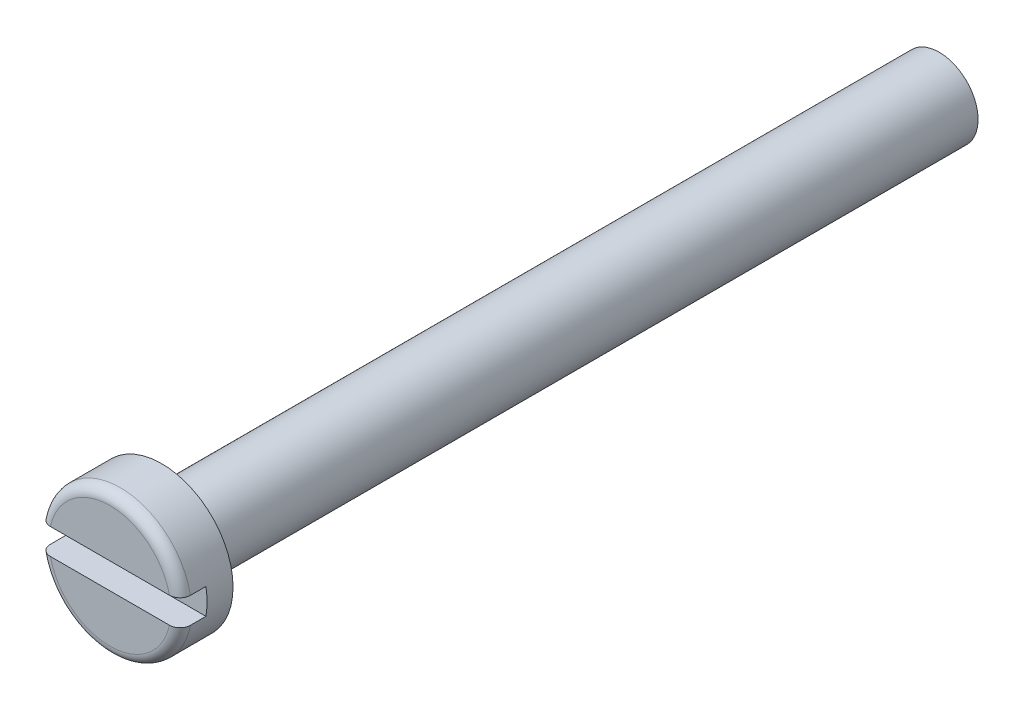
ISO-10303-21;
HEADER;
FILE_DESCRIPTION(('STEP AP214'),'2;1');
FILE_NAME('part.step','',(''),(''),'','','');
FILE_SCHEMA(('AUTOMOTIVE_DESIGN { 1 0 10303 214 1 1 1 1 }'));
ENDSEC;
DATA;
#1=APPLICATION_CONTEXT('core data for automotive mechanical design processes');
#2=APPLICATION_PROTOCOL_DEFINITION('international standard','automotive_design',2000,#1);
#3=PRODUCT_CONTEXT('',#1,'mechanical');
#4=PRODUCT('Part','Part','',(#3));
#5=PRODUCT_RELATED_PRODUCT_CATEGORY('part','',(#4));
#6=PRODUCT_DEFINITION_FORMATION('','',#4);
#7=PRODUCT_DEFINITION_CONTEXT('part definition',#1,'design');
#8=PRODUCT_DEFINITION('design','',#6,#7);
#9=PRODUCT_DEFINITION_SHAPE('','',#8);
#10=(LENGTH_UNIT() NAMED_UNIT(*) SI_UNIT(.MILLI.,.METRE.));
#11=(NAMED_UNIT(*) PLANE_ANGLE_UNIT() SI_UNIT($,.RADIAN.));
#12=(NAMED_UNIT(*) SI_UNIT($,.STERADIAN.) SOLID_ANGLE_UNIT());
#13=UNCERTAINTY_MEASURE_WITH_UNIT(LENGTH_MEASURE(1.E-05),#10,'distance_accuracy_value','');
#14=(GEOMETRIC_REPRESENTATION_CONTEXT(3) GLOBAL_UNCERTAINTY_ASSIGNED_CONTEXT((#13)) GLOBAL_UNIT_ASSIGNED_CONTEXT((#10,
#11,#12)) REPRESENTATION_CONTEXT('',''));
#15=CARTESIAN_POINT('',(0.,0.,0.));
#16=DIRECTION('',(0.,0.,1.));
#17=DIRECTION('',(1.,0.,0.));
#18=AXIS2_PLACEMENT_3D('',#15,#16,#17);
#19=CARTESIAN_POINT('',(0.,0.,2.));
#20=DIRECTION('',(0.,0.,1.));
#21=DIRECTION('',(1.,0.,0.));
#22=AXIS2_PLACEMENT_3D('',#19,#20,#21);
#23=PLANE('',#22);
#24=DIRECTION('',(1.,0.,0.));
#25=VECTOR('',#24,1.);
#26=CARTESIAN_POINT('',(-3.92550642529954,-0.5,2.));
#27=LINE('',#26,#25);
#28=CARTESIAN_POINT('',(-2.29619250064101,-0.5,2.));
#29=VERTEX_POINT('',#28);
#30=CARTESIAN_POINT('',(2.29619250064101,-0.5,2.));
#31=VERTEX_POINT('',#30);
#32=EDGE_CURVE('E104',#29,#31,#27,.T.);
#33=ORIENTED_EDGE('',*,*,#32,.F.);
#34=CARTESIAN_POINT('',(0.,0.,2.));
#35=DIRECTION('',(0.,0.,1.));
#36=DIRECTION('',(1.,0.,0.));
#37=AXIS2_PLACEMENT_3D('',#34,#35,#36);
#38=CIRCLE('',#37,2.35);
#39=EDGE_CURVE('E108',#29,#31,#38,.T.);
#40=ORIENTED_EDGE('',*,*,#39,.T.);
#41=EDGE_LOOP('',(#33,#40));
#42=FACE_BOUND('',#41,.T.);
#43=ADVANCED_FACE('F33',(#42),#23,.T.);
#44=CARTESIAN_POINT('',(0.,0.,1.6));
#45=DIRECTION('',(0.,0.,1.));
#46=DIRECTION('',(1.,0.,0.));
#47=AXIS2_PLACEMENT_3D('',#44,#45,#46);
#48=TOROIDAL_SURFACE('',#47,2.35,0.4);
#49=CARTESIAN_POINT('',(-2.62619038091012,-0.5,1.83544770515883));
#50=CARTESIAN_POINT('',(-2.61263356226729,-0.5,1.85373623025664));
#51=CARTESIAN_POINT('',(-2.59749956242839,-0.5,1.87087869161401));
#52=CARTESIAN_POINT('',(-2.56454221813394,-0.5,1.90237883040798));
#53=CARTESIAN_POINT('',(-2.54671511248543,-0.5,1.91673254796232));
#54=CARTESIAN_POINT('',(-2.5089357551136,-0.5,1.94224083583466));
#55=CARTESIAN_POINT('',(-2.48898626391397,-0.5,1.95339949375539));
#56=CARTESIAN_POINT('',(-2.44752396577556,-0.5,1.97225919789647));
#57=CARTESIAN_POINT('',(-2.42601154513596,-0.5,1.9799610951469));
#58=CARTESIAN_POINT('',(-2.38170155593168,-0.5,1.99181795211972));
#59=CARTESIAN_POINT('',(-2.35889003302304,-0.5,1.99592075157835));
#60=CARTESIAN_POINT('',(-2.31290143156169,-0.5,2.00030498144866));
#61=CARTESIAN_POINT('',(-2.28972430162224,-0.5,2.00058586980512));
#62=CARTESIAN_POINT('',(-2.24326799051151,-0.5,1.99730780671908));
#63=CARTESIAN_POINT('',(-2.21999314999985,-0.5,1.99368710497535));
#64=CARTESIAN_POINT('',(-2.17437295895557,-0.5,1.98261165729567));
#65=CARTESIAN_POINT('',(-2.15202766541745,-0.5,1.97515667663707));
#66=CARTESIAN_POINT('',(-2.10878909796141,-0.5,1.95655872141571));
#67=CARTESIAN_POINT('',(-2.0879039293106,-0.5,1.94539687691259));
#68=CARTESIAN_POINT('',(-2.0483329187925,-0.5,1.9196847476073));
#69=CARTESIAN_POINT('',(-2.0296469974799,-0.5,1.90513458526086));
#70=CARTESIAN_POINT('',(-1.99526919643116,-0.5,1.87322793915014));
#71=CARTESIAN_POINT('',(-1.97954359912245,-0.5,1.85590782263228));
#72=CARTESIAN_POINT('',(-1.95132308293,-0.5,1.8188085014007));
#73=CARTESIAN_POINT('',(-1.93882763644293,-0.5,1.79902969906402));
#74=CARTESIAN_POINT('',(-1.91780235126346,-0.5,1.75816072094503));
#75=CARTESIAN_POINT('',(-1.90917182223496,-0.5,1.73712236345806));
#76=CARTESIAN_POINT('',(-1.89568517834923,-0.5,1.69386915533978));
#77=CARTESIAN_POINT('',(-1.89082831625216,-0.5,1.67165453855563));
#78=CARTESIAN_POINT('',(-1.88515147779902,-0.5,1.62736952064434));
#79=CARTESIAN_POINT('',(-1.88421892462332,-0.5,1.60531349564045));
#80=CARTESIAN_POINT('',(-1.88611470329609,-0.5,1.56136496556786));
#81=CARTESIAN_POINT('',(-1.88894271848453,-0.5,1.53947244688713));
#82=CARTESIAN_POINT('',(-1.89820787052979,-0.5,1.49671300748623));
#83=CARTESIAN_POINT('',(-1.90460608571138,-0.5,1.47583762233463));
#84=CARTESIAN_POINT('',(-1.92076706511562,-0.5,1.43543421848883));
#85=CARTESIAN_POINT('',(-1.93053001760281,-0.5,1.41590627526042));
#86=CARTESIAN_POINT('',(-1.95327387474353,-0.5,1.37843460780815));
#87=CARTESIAN_POINT('',(-1.96629961172802,-0.5,1.36051812530724));
#88=CARTESIAN_POINT('',(-1.99509439024952,-0.5,1.32704642120958));
#89=CARTESIAN_POINT('',(-2.01086381478228,-0.5,1.31149152983955));
#90=CARTESIAN_POINT('',(-2.04519240192099,-0.5,1.28269919385505));
#91=CARTESIAN_POINT('',(-2.0638198755551,-0.5,1.26954319397974));
#92=CARTESIAN_POINT('',(-2.10297306437774,-0.5,1.24644959051631));
#93=CARTESIAN_POINT('',(-2.12349905296588,-0.5,1.23651245139752));
#94=CARTESIAN_POINT('',(-2.16645235686171,-0.5,1.21987982977083));
#95=CARTESIAN_POINT('',(-2.18891559535475,-0.5,1.21327700938222));
#96=CARTESIAN_POINT('',(-2.23462689324369,-0.5,1.20388861373709));
#97=CARTESIAN_POINT('',(-2.25787501610413,-0.5,1.20110334792322));
#98=CARTESIAN_POINT('',(-2.30477444629637,-0.5,1.19942424019881));
#99=CARTESIAN_POINT('',(-2.32842735100207,-0.5,1.20057440024381));
#100=CARTESIAN_POINT('',(-2.37520044576303,-0.5,1.20685220842419));
#101=CARTESIAN_POINT('',(-2.39832064202178,-0.5,1.2119798102173));
#102=CARTESIAN_POINT('',(-2.44322365819375,-0.5,1.22605462671592));
#103=CARTESIAN_POINT('',(-2.46501338004882,-0.5,1.23497979435747));
#104=CARTESIAN_POINT('',(-2.50674878210765,-0.5,1.25642175857502));
#105=CARTESIAN_POINT('',(-2.52669460796329,-0.5,1.26893827114465));
#106=CARTESIAN_POINT('',(-2.56381815052492,-0.5,1.29699037466751));
#107=CARTESIAN_POINT('',(-2.581036270014,-0.5,1.31247248392922));
#108=CARTESIAN_POINT('',(-2.61256596627527,-0.5,1.34615807457712));
#109=CARTESIAN_POINT('',(-2.62687784820374,-0.5,1.36436126989919));
#110=CARTESIAN_POINT('',(-2.65190073733828,-0.5,1.40259690391388));
#111=CARTESIAN_POINT('',(-2.66267533478993,-0.5,1.42258773469947));
#112=CARTESIAN_POINT('',(-2.68065593055762,-0.5,1.46411367848379));
#113=CARTESIAN_POINT('',(-2.68786240237232,-0.5,1.48564858614544));
#114=CARTESIAN_POINT('',(-2.6983988782491,-0.5,1.52930119247272));
#115=CARTESIAN_POINT('',(-2.70178583819472,-0.5,1.55140515911834));
#116=CARTESIAN_POINT('',(-2.704772478132,-0.5,1.59587340763234));
#117=CARTESIAN_POINT('',(-2.70437137438759,-0.5,1.61823774241392));
#118=CARTESIAN_POINT('',(-2.69980893202067,-0.5,1.66243006884283));
#119=CARTESIAN_POINT('',(-2.6956719204913,-0.5,1.68426059323067));
#120=CARTESIAN_POINT('',(-2.68380053632379,-0.5,1.72689974520276));
#121=CARTESIAN_POINT('',(-2.67607067463867,-0.5,1.74770961813577));
#122=CARTESIAN_POINT('',(-2.66106770941279,-0.5,1.77964182264717));
#123=CARTESIAN_POINT('',(-2.65487094721183,-0.5,1.79128235889515));
#124=CARTESIAN_POINT('',(-2.6413557076963,-0.5,1.8138924805216));
#125=CARTESIAN_POINT('',(-2.63403724129826,-0.5,1.8248620724283));
#126=CARTESIAN_POINT('',(-2.62619038091012,-0.5,1.83544770515883));
#127=B_SPLINE_CURVE_WITH_KNOTS('',3,(#49,#50,#51,#52,#53,#54,#55,#56,#57,#58,#59,#60,#61,#62,
#63,#64,#65,#66,#67,#68,#69,#70,#71,#72,#73,#74,#75,#76,#77,#78,#79,#80,#81,#82,#83,#84,#85,#86,
#87,#88,#89,#90,#91,#92,#93,#94,#95,#96,#97,#98,#99,#100,#101,#102,#103,#104,#105,#106,#107,
#108,#109,#110,#111,#112,#113,#114,#115,#116,#117,#118,#119,#120,#121,#122,#123,#124,#125,#126),
.UNSPECIFIED.,.T.,.F.,(4,2,2,2,2,2,2,2,2,2,2,2,2,2,2,2,2,2,2,2,2,2,2,2,2,2,2,2,2,2,2,2,2,2,2,2,
2,2,4),(0.,0.0682466075946623,0.136589424983843,0.204844413213554,0.27308258831698,
0.342294107419759,0.411515442573491,0.481848652692143,0.552186168904159,0.622887374396228,
0.693586025103103,0.763422946686154,0.833248454094187,0.901130604340126,0.968999309524789,
1.03490719957912,1.10080954018712,1.16600707965001,1.23120826765307,1.29735986584561,
1.36352070566509,1.43162394658118,1.49973701016197,1.56965109030662,1.63957083719914,
1.71027489879905,1.78097813661885,1.85127638474918,1.92156907517067,1.99069662744444,
2.05981691753606,2.12761622572643,2.19540653437585,2.26217201672031,2.32895131289338,
2.39529887364471,2.46156335672852,2.50106575233715,2.5405677635293),.UNSPECIFIED.);
#128=CARTESIAN_POINT('',(-2.70416345659957,-0.5,1.60000000000024));
#129=VERTEX_POINT('',#128);
#130=EDGE_CURVE('E159',#129,#29,#127,.T.);
#131=ORIENTED_EDGE('',*,*,#130,.F.);
#132=CARTESIAN_POINT('',(0.,0.,1.6));
#133=DIRECTION('',(0.,0.,1.));
#134=DIRECTION('',(1.,0.,0.));
#135=AXIS2_PLACEMENT_3D('',#132,#133,#134);
#136=CIRCLE('',#135,2.75);
#137=CARTESIAN_POINT('',(2.70416345659799,-0.5,1.6));
#138=VERTEX_POINT('',#137);
#139=EDGE_CURVE('E98',#138,#129,#136,.F.);
#140=ORIENTED_EDGE('',*,*,#139,.F.);
#141=CARTESIAN_POINT('',(1.92898309832126,-0.5,1.77988516986034));
#142=CARTESIAN_POINT('',(1.93949314461507,-0.5,1.80008889508743));
#143=CARTESIAN_POINT('',(1.9517593009419,-0.5,1.81940117916716));
#144=CARTESIAN_POINT('',(1.97939319938233,-0.5,1.85569065074395));
#145=CARTESIAN_POINT('',(1.99476579816306,-0.5,1.8726641109168));
#146=CARTESIAN_POINT('',(2.02809475448498,-0.5,1.9037852390774));
#147=CARTESIAN_POINT('',(2.0460465708081,-0.5,1.91793777143818));
#148=CARTESIAN_POINT('',(2.08402281258443,-0.5,1.94309729142046));
#149=CARTESIAN_POINT('',(2.10404669450162,-0.5,1.95410510111816));
#150=CARTESIAN_POINT('',(2.14605533698852,-0.5,1.97291081898203));
#151=CARTESIAN_POINT('',(2.16807240860476,-0.5,1.98063658560144));
#152=CARTESIAN_POINT('',(2.21308297016805,-0.5,1.99234115731671));
#153=CARTESIAN_POINT('',(2.23607659861224,-0.5,1.99631942906876));
#154=CARTESIAN_POINT('',(2.28273224588002,-0.5,2.00044623133229));
#155=CARTESIAN_POINT('',(2.30639911630732,-0.5,2.00054021782789));
#156=CARTESIAN_POINT('',(2.35341169198468,-0.5,1.99674061125416));
#157=CARTESIAN_POINT('',(2.37675739657881,-0.5,1.99284701004225));
#158=CARTESIAN_POINT('',(2.42237496676976,-0.5,1.9811754503234));
#159=CARTESIAN_POINT('',(2.44465017067156,-0.5,1.97341056064841));
#160=CARTESIAN_POINT('',(2.48755003023635,-0.5,1.95419365820212));
#161=CARTESIAN_POINT('',(2.50817481050276,-0.5,1.94274192410815));
#162=CARTESIAN_POINT('',(2.54684281436288,-0.5,1.91665872778678));
#163=CARTESIAN_POINT('',(2.56492096377046,-0.5,1.90207906041399));
#164=CARTESIAN_POINT('',(2.59831240421815,-0.5,1.87003740057132));
#165=CARTESIAN_POINT('',(2.61362598376942,-0.5,1.85257570923464));
#166=CARTESIAN_POINT('',(2.64074157086097,-0.5,1.81562763426819));
#167=CARTESIAN_POINT('',(2.65260546308916,-0.5,1.79618666114354));
#168=CARTESIAN_POINT('',(2.67283925008361,-0.5,1.75556423228347));
#169=CARTESIAN_POINT('',(2.68120948302296,-0.5,1.73438294524156));
#170=CARTESIAN_POINT('',(2.6940865759711,-0.5,1.69124634781257));
#171=CARTESIAN_POINT('',(2.6986530401699,-0.5,1.66930881716444));
#172=CARTESIAN_POINT('',(2.70400363251708,-0.5,1.62497758367981));
#173=CARTESIAN_POINT('',(2.70478798437058,-0.5,1.60258390790215));
#174=CARTESIAN_POINT('',(2.70255963456268,-0.5,1.55817508605599));
#175=CARTESIAN_POINT('',(2.6995786366752,-0.5,1.53615834054798));
#176=CARTESIAN_POINT('',(2.68996584539524,-0.5,1.49293756475967));
#177=CARTESIAN_POINT('',(2.68333409261704,-0.5,1.47173352544089));
#178=CARTESIAN_POINT('',(2.66661342677101,-0.5,1.43071097050886));
#179=CARTESIAN_POINT('',(2.65652094915892,-0.5,1.41089390892357));
#180=CARTESIAN_POINT('',(2.63318377216481,-0.5,1.37321317440286));
#181=CARTESIAN_POINT('',(2.61993895661573,-0.5,1.35534957348998));
#182=CARTESIAN_POINT('',(2.590538503046,-0.5,1.32188398012138));
#183=CARTESIAN_POINT('',(2.57435492939053,-0.5,1.30630654055154));
#184=CARTESIAN_POINT('',(2.53963984662458,-0.5,1.27803627960591));
#185=CARTESIAN_POINT('',(2.52110815938156,-0.5,1.26534367728386));
#186=CARTESIAN_POINT('',(2.4818942186644,-0.5,1.24297331584829));
#187=CARTESIAN_POINT('',(2.46118117706353,-0.5,1.2333495387349));
#188=CARTESIAN_POINT('',(2.4184539035586,-0.5,1.21764307888103));
#189=CARTESIAN_POINT('',(2.39643954246585,-0.5,1.21156074837075));
#190=CARTESIAN_POINT('',(2.35128991041328,-0.5,1.20299254848139));
#191=CARTESIAN_POINT('',(2.32814131590417,-0.5,1.2005768527655));
#192=CARTESIAN_POINT('',(2.28176297036809,-0.5,1.19960634410731));
#193=CARTESIAN_POINT('',(2.25853321192711,-0.5,1.20105189359859));
#194=CARTESIAN_POINT('',(2.2123001564848,-0.5,1.20780242823378));
#195=CARTESIAN_POINT('',(2.18930486959504,-0.5,1.21316239962444));
#196=CARTESIAN_POINT('',(2.1445354231758,-0.5,1.22765880273197));
#197=CARTESIAN_POINT('',(2.12276132362222,-0.5,1.23679541974625));
#198=CARTESIAN_POINT('',(2.08102751402734,-0.5,1.25862731323666));
#199=CARTESIAN_POINT('',(2.0610709290768,-0.5,1.2713285713681));
#200=CARTESIAN_POINT('',(2.02361732194556,-0.5,1.29995272784891));
#201=CARTESIAN_POINT('',(2.00612014798541,-0.5,1.31587542724303));
#202=CARTESIAN_POINT('',(1.9744068337949,-0.5,1.35023090404912));
#203=CARTESIAN_POINT('',(1.96014199196738,-0.5,1.36861868236077));
#204=CARTESIAN_POINT('',(1.93501444197417,-0.5,1.40758789318503));
#205=CARTESIAN_POINT('',(1.92415096194598,-0.5,1.42816882658752));
#206=CARTESIAN_POINT('',(1.90648158069921,-0.5,1.47028255049213));
#207=CARTESIAN_POINT('',(1.89956424089211,-0.5,1.49176859032654));
#208=CARTESIAN_POINT('',(1.88954358916969,-0.5,1.53561833365207));
#209=CARTESIAN_POINT('',(1.88644059492938,-0.5,1.5579821100848));
#210=CARTESIAN_POINT('',(1.88419399660113,-0.5,1.60232401591841));
#211=CARTESIAN_POINT('',(1.88495020820612,-0.5,1.62429718905239));
#212=CARTESIAN_POINT('',(1.89016522602117,-0.5,1.66777914342288));
#213=CARTESIAN_POINT('',(1.89461913139879,-0.5,1.68928850069664));
#214=CARTESIAN_POINT('',(1.90439908778385,-0.5,1.7222793577135));
#215=CARTESIAN_POINT('',(1.90854271203907,-0.5,1.73412463728708));
#216=CARTESIAN_POINT('',(1.91794113042095,-0.5,1.75736508634642));
#217=CARTESIAN_POINT('',(1.92319588804724,-0.5,1.76876027060308));
#218=CARTESIAN_POINT('',(1.92898309832126,-0.5,1.77988516986034));
#219=B_SPLINE_CURVE_WITH_KNOTS('',3,(#141,#142,#143,#144,#145,#146,#147,#148,#149,#150,#151,
#152,#153,#154,#155,#156,#157,#158,#159,#160,#161,#162,#163,#164,#165,#166,#167,#168,#169,#170,
#171,#172,#173,#174,#175,#176,#177,#178,#179,#180,#181,#182,#183,#184,#185,#186,#187,#188,#189,
#190,#191,#192,#193,#194,#195,#196,#197,#198,#199,#200,#201,#202,#203,#204,#205,#206,#207,#208,
#209,#210,#211,#212,#213,#214,#215,#216,#217,#218),.UNSPECIFIED.,.T.,.F.,(4,2,2,2,2,2,2,2,2,2,2,
2,2,2,2,2,2,2,2,2,2,2,2,2,2,2,2,2,2,2,2,2,2,2,2,2,2,2,4),(0.,0.0682742800464667,
0.136656138832765,0.204919040780091,0.273164081449024,0.342840022244376,0.412525877828525,
0.483189950363971,0.553854167194391,0.624281432310178,0.694703375293182,0.764038604757446,
0.833366594192709,0.901360931684987,0.969348686053635,1.03624990314771,1.10314716310718,
1.16948489281394,1.2358218845349,1.3022274095799,1.36863538211929,1.43571124768699,
1.50279220481245,1.57099525285094,1.63920508316653,1.70870457623849,1.77821059306995,
1.84871221925534,1.91921730494445,1.98984141663846,2.0604611679389,2.12993321428263,
2.19938948406389,2.26677249506838,2.33416111763805,2.39980938400633,2.46537078042,
2.50296629444463,2.54056057366004),.UNSPECIFIED.);
#220=EDGE_CURVE('E160',#31,#138,#219,.T.);
#221=ORIENTED_EDGE('',*,*,#220,.F.);
#222=ORIENTED_EDGE('',*,*,#39,.F.);
#223=EDGE_LOOP('',(#131,#140,#221,#222));
#224=FACE_BOUND('',#223,.T.);
#225=ADVANCED_FACE('F141',(#224),#48,.T.);
#226=CARTESIAN_POINT('',(0.,0.,2.));
#227=DIRECTION('',(0.,0.,-1.));
#228=DIRECTION('',(-1.,0.,0.));
#229=AXIS2_PLACEMENT_3D('',#226,#227,#228);
#230=CYLINDRICAL_SURFACE('',#229,2.75);
#231=CARTESIAN_POINT('',(0.,0.,1.));
#232=DIRECTION('',(0.,0.,-1.));
#233=DIRECTION('',(-1.,0.,0.));
#234=AXIS2_PLACEMENT_3D('',#231,#232,#233);
#235=CIRCLE('',#234,2.75);
#236=CARTESIAN_POINT('',(2.70416345659799,0.5,1.));
#237=VERTEX_POINT('',#236);
#238=CARTESIAN_POINT('',(2.70416345659799,-0.5,1.));
#239=VERTEX_POINT('',#238);
#240=EDGE_CURVE('E43',#237,#239,#235,.T.);
#241=ORIENTED_EDGE('',*,*,#240,.T.);
#242=DIRECTION('',(0.,0.,-1.));
#243=VECTOR('',#242,1.);
#244=CARTESIAN_POINT('',(2.70416345659799,-0.5,2.));
#245=LINE('',#244,#243);
#246=EDGE_CURVE('E172',#239,#138,#245,.F.);
#247=ORIENTED_EDGE('',*,*,#246,.T.);
#248=ORIENTED_EDGE('',*,*,#139,.T.);
#249=DIRECTION('',(0.,0.,-1.));
#250=VECTOR('',#249,1.);
#251=CARTESIAN_POINT('',(-2.70416345659799,-0.5,2.));
#252=LINE('',#251,#250);
#253=CARTESIAN_POINT('',(-2.70416345659799,-0.5,1.));
#254=VERTEX_POINT('',#253);
#255=EDGE_CURVE('E59',#129,#254,#252,.T.);
#256=ORIENTED_EDGE('',*,*,#255,.T.);
#257=CARTESIAN_POINT('',(-2.70416345659799,0.5,1.));
#258=VERTEX_POINT('',#257);
#259=EDGE_CURVE('E38',#254,#258,#235,.T.);
#260=ORIENTED_EDGE('',*,*,#259,.T.);
#261=DIRECTION('',(0.,0.,-1.));
#262=VECTOR('',#261,1.);
#263=CARTESIAN_POINT('',(-2.70416345659799,0.5,2.));
#264=LINE('',#263,#262);
#265=CARTESIAN_POINT('',(-2.70416345659799,0.5,1.6));
#266=VERTEX_POINT('',#265);
#267=EDGE_CURVE('E169',#258,#266,#264,.F.);
#268=ORIENTED_EDGE('',*,*,#267,.T.);
#269=CARTESIAN_POINT('',(2.70416345659799,0.5,1.6));
#270=VERTEX_POINT('',#269);
#271=EDGE_CURVE('E107',#266,#270,#136,.F.);
#272=ORIENTED_EDGE('',*,*,#271,.T.);
#273=DIRECTION('',(0.,0.,-1.));
#274=VECTOR('',#273,1.);
#275=CARTESIAN_POINT('',(2.70416345659799,0.5,2.));
#276=LINE('',#275,#274);
#277=EDGE_CURVE('E51',#270,#237,#276,.T.);
#278=ORIENTED_EDGE('',*,*,#277,.T.);
#279=EDGE_LOOP('',(#241,#247,#248,#256,#260,#268,#272,#278));
#280=FACE_BOUND('',#279,.T.);
#281=CARTESIAN_POINT('',(0.,0.,0.));
#282=DIRECTION('',(0.,0.,1.));
#283=DIRECTION('',(1.,0.,0.));
#284=AXIS2_PLACEMENT_3D('',#281,#282,#283);
#285=CIRCLE('',#284,2.75);
#286=CARTESIAN_POINT('',(2.75,0.,0.));
#287=VERTEX_POINT('',#286);
#288=EDGE_CURVE('E112',#287,#287,#285,.T.);
#289=ORIENTED_EDGE('',*,*,#288,.T.);
#290=EDGE_LOOP('',(#289));
#291=FACE_BOUND('',#290,.T.);
#292=ADVANCED_FACE('F137',(#280,#291),#230,.T.);
#293=DIRECTION('',(-1.,0.,0.));
#294=VECTOR('',#293,1.);
#295=CARTESIAN_POINT('',(-3.92550642529954,0.5,2.));
#296=LINE('',#295,#294);
#297=CARTESIAN_POINT('',(2.29619250064101,0.5,2.));
#298=VERTEX_POINT('',#297);
#299=CARTESIAN_POINT('',(-2.29619250064101,0.5,2.));
#300=VERTEX_POINT('',#299);
#301=EDGE_CURVE('E91',#298,#300,#296,.T.);
#302=ORIENTED_EDGE('',*,*,#301,.F.);
#303=EDGE_CURVE('E103',#298,#300,#38,.T.);
#304=ORIENTED_EDGE('',*,*,#303,.T.);
#305=EDGE_LOOP('',(#302,#304));
#306=FACE_BOUND('',#305,.T.);
#307=ADVANCED_FACE('F102',(#306),#23,.T.);
#308=CARTESIAN_POINT('',(0.,0.,0.));
#309=DIRECTION('',(0.,0.,1.));
#310=DIRECTION('',(1.,0.,0.));
#311=AXIS2_PLACEMENT_3D('',#308,#309,#310);
#312=PLANE('',#311);
#313=CARTESIAN_POINT('',(0.,0.,0.));
#314=DIRECTION('',(0.,0.,-1.));
#315=DIRECTION('',(-1.,0.,0.));
#316=AXIS2_PLACEMENT_3D('',#313,#314,#315);
#317=CIRCLE('',#316,1.5);
#318=CARTESIAN_POINT('',(-1.5,0.,0.));
#319=VERTEX_POINT('',#318);
#320=EDGE_CURVE('E11',#319,#319,#317,.T.);
#321=ORIENTED_EDGE('',*,*,#320,.F.);
#322=EDGE_LOOP('',(#321));
#323=FACE_BOUND('',#322,.T.);
#324=ORIENTED_EDGE('',*,*,#288,.F.);
#325=EDGE_LOOP('',(#324));
#326=FACE_BOUND('',#325,.T.);
#327=ADVANCED_FACE('F136',(#323,#326),#312,.F.);
#328=CARTESIAN_POINT('',(-2.62619038091012,0.5,1.83544770515883));
#329=CARTESIAN_POINT('',(-2.63943556158204,0.5,1.81757619153944));
#330=CARTESIAN_POINT('',(-2.65119429851434,0.5,1.79858477685465));
#331=CARTESIAN_POINT('',(-2.67137261425435,0.5,1.75888568917943));
#332=CARTESIAN_POINT('',(-2.6797887668081,0.5,1.73817628133465));
#333=CARTESIAN_POINT('',(-2.69301259878575,0.5,1.6956340645877));
#334=CARTESIAN_POINT('',(-2.6978204445115,0.5,1.6738013075087));
#335=CARTESIAN_POINT('',(-2.70367644245193,0.5,1.62964222952785));
#336=CARTESIAN_POINT('',(-2.7047254472561,0.5,1.60731602170785));
#337=CARTESIAN_POINT('',(-2.70303883872591,0.5,1.56293657544277));
#338=CARTESIAN_POINT('',(-2.70032502915939,0.5,1.54088250526274));
#339=CARTESIAN_POINT('',(-2.69123516166887,0.5,1.49754257605441));
#340=CARTESIAN_POINT('',(-2.68485903309423,0.5,1.47625673185455));
#341=CARTESIAN_POINT('',(-2.66863370042927,0.5,1.43503695682057));
#342=CARTESIAN_POINT('',(-2.65878212638013,0.5,1.41510395960082));
#343=CARTESIAN_POINT('',(-2.63590320684239,0.5,1.37715365307851));
#344=CARTESIAN_POINT('',(-2.62287575421323,0.5,1.35913640843471));
#345=CARTESIAN_POINT('',(-2.59388692622622,0.5,1.32533411245406));
#346=CARTESIAN_POINT('',(-2.57789814681159,0.5,1.30957257318368));
#347=CARTESIAN_POINT('',(-2.54353922379496,0.5,1.28090509937311));
#348=CARTESIAN_POINT('',(-2.52516890570312,0.5,1.26799937425957));
#349=CARTESIAN_POINT('',(-2.48624614974059,0.5,1.24517815271556));
#350=CARTESIAN_POINT('',(-2.46566262535548,0.5,1.23531568839962));
#351=CARTESIAN_POINT('',(-2.42315335711336,0.5,1.2191137313571));
#352=CARTESIAN_POINT('',(-2.40122747994987,0.5,1.21277458915698));
#353=CARTESIAN_POINT('',(-2.35621248407481,0.5,1.20367618821732));
#354=CARTESIAN_POINT('',(-2.33310920143531,0.5,1.20098697735059));
#355=CARTESIAN_POINT('',(-2.28677559093029,0.5,1.19946452423188));
#356=CARTESIAN_POINT('',(-2.26354525114654,0.5,1.20063165012769));
#357=CARTESIAN_POINT('',(-2.21725736831256,0.5,1.2068240336115));
#358=CARTESIAN_POINT('',(-2.19420732349194,0.5,1.21190547717133));
#359=CARTESIAN_POINT('',(-2.14928165179076,0.5,1.22585565279472));
#360=CARTESIAN_POINT('',(-2.12740608347093,0.5,1.23472457350914));
#361=CARTESIAN_POINT('',(-2.08541122438646,0.5,1.25604448676793));
#362=CARTESIAN_POINT('',(-2.06529603496402,0.5,1.26850356848307));
#363=CARTESIAN_POINT('',(-2.0274843152291,0.5,1.29667182889313));
#364=CARTESIAN_POINT('',(-2.00978764342122,0.5,1.31238081731695));
#365=CARTESIAN_POINT('',(-1.97763173029618,0.5,1.34635825466517));
#366=CARTESIAN_POINT('',(-1.96312622424411,0.5,1.3645828764079));
#367=CARTESIAN_POINT('',(-1.93749100176534,0.5,1.40327013473386));
#368=CARTESIAN_POINT('',(-1.92636066886875,0.5,1.42373236169205));
#369=CARTESIAN_POINT('',(-1.90814542942036,0.5,1.46566806270434));
#370=CARTESIAN_POINT('',(-1.90095089854368,0.5,1.48709391707931));
#371=CARTESIAN_POINT('',(-1.89037317534363,0.5,1.53086602468563));
#372=CARTESIAN_POINT('',(-1.88698927760945,0.5,1.55321210677354));
#373=CARTESIAN_POINT('',(-1.88419509622963,0.5,1.59754791268507));
#374=CARTESIAN_POINT('',(-1.88468075659553,0.5,1.61953113848417));
#375=CARTESIAN_POINT('',(-1.88936108020425,0.5,1.66309776076633));
#376=CARTESIAN_POINT('',(-1.89355553618974,0.5,1.68468117952286));
#377=CARTESIAN_POINT('',(-1.9054702587881,0.5,1.72671080478938));
#378=CARTESIAN_POINT('',(-1.91316949996261,0.5,1.74716298856517));
#379=CARTESIAN_POINT('',(-1.93183126155128,0.5,1.7865183577852));
#380=CARTESIAN_POINT('',(-1.94279403033335,0.5,1.80542142519562));
#381=CARTESIAN_POINT('',(-1.967872059386,0.5,1.84152838350092));
#382=CARTESIAN_POINT('',(-1.98204205253192,0.5,1.85869422693093));
#383=CARTESIAN_POINT('',(-2.01298581366211,0.5,1.89049090818236));
#384=CARTESIAN_POINT('',(-2.02975996802283,0.5,1.9051213691492));
#385=CARTESIAN_POINT('',(-2.06597789220007,0.5,1.93189651937547));
#386=CARTESIAN_POINT('',(-2.08548688213994,0.5,1.94395300523557));
#387=CARTESIAN_POINT('',(-2.12621515987836,0.5,1.9647105952624));
#388=CARTESIAN_POINT('',(-2.14743468393851,0.5,1.97341123495113));
#389=CARTESIAN_POINT('',(-2.19153655814735,0.5,1.98741098289603));
#390=CARTESIAN_POINT('',(-2.21444674697052,0.5,1.99262252640992));
#391=CARTESIAN_POINT('',(-2.26081503686524,0.5,1.99915941550779));
#392=CARTESIAN_POINT('',(-2.28427315233682,0.5,2.00048465884007));
#393=CARTESIAN_POINT('',(-2.33126479916545,0.5,1.99919535372034));
#394=CARTESIAN_POINT('',(-2.35479750352534,0.5,1.99655015771656));
#395=CARTESIAN_POINT('',(-2.40108261764842,0.5,1.98731184032283));
#396=CARTESIAN_POINT('',(-2.42383485440922,0.5,1.98071784952596));
#397=CARTESIAN_POINT('',(-2.46770478500229,0.5,1.96380916884184));
#398=CARTESIAN_POINT('',(-2.48883395596331,0.5,1.95352423664352));
#399=CARTESIAN_POINT('',(-2.52900281580252,0.5,1.92949736161691));
#400=CARTESIAN_POINT('',(-2.54804518184574,0.5,1.9157599243709));
#401=CARTESIAN_POINT('',(-2.57698218910246,0.5,1.89080791856032));
#402=CARTESIAN_POINT('',(-2.5876768589988,0.5,1.88050578352457));
#403=CARTESIAN_POINT('',(-2.60786479189688,0.5,1.85878431757819));
#404=CARTESIAN_POINT('',(-2.61735807105904,0.5,1.84736500169891));
#405=CARTESIAN_POINT('',(-2.62619038091012,0.5,1.83544770515883));
#406=B_SPLINE_CURVE_WITH_KNOTS('',3,(#328,#329,#330,#331,#332,#333,#334,#335,#336,#337,#338,
#339,#340,#341,#342,#343,#344,#345,#346,#347,#348,#349,#350,#351,#352,#353,#354,#355,#356,#357,
#358,#359,#360,#361,#362,#363,#364,#365,#366,#367,#368,#369,#370,#371,#372,#373,#374,#375,#376,
#377,#378,#379,#380,#381,#382,#383,#384,#385,#386,#387,#388,#389,#390,#391,#392,#393,#394,#395,
#396,#397,#398,#399,#400,#401,#402,#403,#404,#405),.UNSPECIFIED.,.T.,.F.,(4,2,2,2,2,2,2,2,2,2,2,
2,2,2,2,2,2,2,2,2,2,2,2,2,2,2,2,2,2,2,2,2,2,2,2,2,2,2,4),(0.,0.0666807049951863,
0.13342958448713,0.200175387427213,0.266906049962604,0.333251651004691,0.399598531977895,
0.46599074362527,0.532385195371929,0.599427903132186,0.666475525735889,0.734632961486323,
0.802797176835374,0.872251902802381,0.941713259503038,1.01219067805899,1.08267160744189,
1.153312599544,1.22394945702336,1.29348260413146,1.36300304346345,1.43047323665775,
1.49793093795643,1.5635808870334,1.62922716764894,1.69448471875257,1.75974723749525,
1.82622100523716,1.8927046450588,1.96119193679415,2.02968870436158,2.09984582138114,
2.17000478427481,2.24070809151615,2.31142697124454,2.38158804757789,2.45165803359933,
2.49612345731021,2.54058828283387),.UNSPECIFIED.);
#407=EDGE_CURVE('E97',#300,#266,#406,.T.);
#408=ORIENTED_EDGE('',*,*,#407,.F.);
#409=ORIENTED_EDGE('',*,*,#303,.F.);
#410=CARTESIAN_POINT('',(1.92898309832126,0.5,1.77988516986034));
#411=CARTESIAN_POINT('',(1.91888356328548,0.5,1.76046626541941));
#412=CARTESIAN_POINT('',(1.91039129178636,0.5,1.74019637241814));
#413=CARTESIAN_POINT('',(1.89691429479011,0.5,1.69850683716752));
#414=CARTESIAN_POINT('',(1.89193259268104,0.5,1.67708622092993));
#415=CARTESIAN_POINT('',(1.88565762043469,0.5,1.63370459182279));
#416=CARTESIAN_POINT('',(1.88436503091333,0.5,1.61174347998923));
#417=CARTESIAN_POINT('',(1.88551768473585,0.5,1.56792441896949));
#418=CARTESIAN_POINT('',(1.88796218638399,0.5,1.54606645017623));
#419=CARTESIAN_POINT('',(1.89646903371677,0.5,1.50323287045499));
#420=CARTESIAN_POINT('',(1.90250506699523,0.5,1.48225201838002));
#421=CARTESIAN_POINT('',(1.91796837951359,0.5,1.44158079176921));
#422=CARTESIAN_POINT('',(1.92739592131461,0.5,1.42189051728582));
#423=CARTESIAN_POINT('',(1.94948676016105,0.5,1.38406416069708));
#424=CARTESIAN_POINT('',(1.96219172187497,0.5,1.36595243920908));
#425=CARTESIAN_POINT('',(1.99038192962909,0.5,1.3320416240896));
#426=CARTESIAN_POINT('',(2.00586755250909,0.5,1.31624284443928));
#427=CARTESIAN_POINT('',(2.03965845561019,0.5,1.2869177992227));
#428=CARTESIAN_POINT('',(2.05803253959432,0.5,1.2734708181514));
#429=CARTESIAN_POINT('',(2.09672889057764,0.5,1.24975601332516));
#430=CARTESIAN_POINT('',(2.11705143937553,0.5,1.23948865033675));
#431=CARTESIAN_POINT('',(2.15965952783986,0.5,1.22214971032024));
#432=CARTESIAN_POINT('',(2.18198323315404,0.5,1.21517181796021));
#433=CARTESIAN_POINT('',(2.22747907200016,0.5,1.20501161150673));
#434=CARTESIAN_POINT('',(2.25065127811407,0.5,1.20182962290576));
#435=CARTESIAN_POINT('',(2.29748683285479,0.5,1.19933889468752));
#436=CARTESIAN_POINT('',(2.32115272935516,0.5,1.20007761680271));
#437=CARTESIAN_POINT('',(2.36802177153292,0.5,1.2055373894662));
#438=CARTESIAN_POINT('',(2.39122492009407,0.5,1.21025841518956));
#439=CARTESIAN_POINT('',(2.43638010491662,0.5,1.22354356549718));
#440=CARTESIAN_POINT('',(2.45833777619757,0.5,1.23208851088178));
#441=CARTESIAN_POINT('',(2.50047235355312,0.5,1.25280293847511));
#442=CARTESIAN_POINT('',(2.52064939909296,0.5,1.26497213649168));
#443=CARTESIAN_POINT('',(2.55829537444405,0.5,1.29238382669168));
#444=CARTESIAN_POINT('',(2.57580292083698,0.5,1.3075732696659));
#445=CARTESIAN_POINT('',(2.60795716785375,0.5,1.34072754808068));
#446=CARTESIAN_POINT('',(2.62260417360379,0.5,1.35869208714267));
#447=CARTESIAN_POINT('',(2.6483251054936,0.5,1.39651489835394));
#448=CARTESIAN_POINT('',(2.65946218755153,0.5,1.416330229339));
#449=CARTESIAN_POINT('',(2.67819156976632,0.5,1.45757084739681));
#450=CARTESIAN_POINT('',(2.68578420071236,0.5,1.47899598401621));
#451=CARTESIAN_POINT('',(2.69709645956428,0.5,1.52249363287184));
#452=CARTESIAN_POINT('',(2.70087372030082,0.5,1.54455116996287));
#453=CARTESIAN_POINT('',(2.70464077258904,0.5,1.58898693701621));
#454=CARTESIAN_POINT('',(2.70463077130782,0.5,1.61136514937029));
#455=CARTESIAN_POINT('',(2.70083824972016,0.5,1.65563113160163));
#456=CARTESIAN_POINT('',(2.69708374500691,0.5,1.67752130946077));
#457=CARTESIAN_POINT('',(2.68595986268898,0.5,1.72036227977701));
#458=CARTESIAN_POINT('',(2.67859050494162,0.5,1.74131307739369));
#459=CARTESIAN_POINT('',(2.6604424279629,0.5,1.78173195254356));
#460=CARTESIAN_POINT('',(2.64965682747701,0.5,1.80119693817063));
#461=CARTESIAN_POINT('',(2.62500416552493,0.5,1.83806527857818));
#462=CARTESIAN_POINT('',(2.61113697961522,0.5,1.85546855005704));
#463=CARTESIAN_POINT('',(2.58056048048577,0.5,1.88792887860268));
#464=CARTESIAN_POINT('',(2.56382184058882,0.5,1.90295829956177));
#465=CARTESIAN_POINT('',(2.52809565352689,0.5,1.93005011822437));
#466=CARTESIAN_POINT('',(2.50910792387783,0.5,1.94211227492876));
#467=CARTESIAN_POINT('',(2.46907566785538,0.5,1.96315136917279));
#468=CARTESIAN_POINT('',(2.44800137830093,0.5,1.97207166347845));
#469=CARTESIAN_POINT('',(2.40467216117768,0.5,1.98632094371028));
#470=CARTESIAN_POINT('',(2.38241711382142,0.5,1.99164956450804));
#471=CARTESIAN_POINT('',(2.33691127853719,0.5,1.9986644779444));
#472=CARTESIAN_POINT('',(2.31364963652678,0.5,2.00028041186143));
#473=CARTESIAN_POINT('',(2.26718005604245,0.5,1.99963991792436));
#474=CARTESIAN_POINT('',(2.24397212060344,0.5,1.99738327633902));
#475=CARTESIAN_POINT('',(2.19794314172286,0.5,1.989011651169));
#476=CARTESIAN_POINT('',(2.17513132634033,0.5,1.98284583730977));
#477=CARTESIAN_POINT('',(2.13085826332264,0.5,1.96677116659981));
#478=CARTESIAN_POINT('',(2.10939739841568,0.5,1.95686125455315));
#479=CARTESIAN_POINT('',(2.06845012433495,0.5,1.93355206955397));
#480=CARTESIAN_POINT('',(2.0489645789842,0.5,1.92015127907862));
#481=CARTESIAN_POINT('',(2.01259027447004,0.5,1.8902216412127));
#482=CARTESIAN_POINT('',(1.99569823124763,0.5,1.87369680987944));
#483=CARTESIAN_POINT('',(1.97039667017465,0.5,1.84421673853661));
#484=CARTESIAN_POINT('',(1.9610830273132,0.5,1.83202558050851));
#485=CARTESIAN_POINT('',(1.94391141218383,0.5,1.8066570089343));
#486=CARTESIAN_POINT('',(1.93605340523504,0.5,1.7934796188959));
#487=CARTESIAN_POINT('',(1.92898309832126,0.5,1.77988516986034));
#488=B_SPLINE_CURVE_WITH_KNOTS('',3,(#410,#411,#412,#413,#414,#415,#416,#417,#418,#419,#420,
#421,#422,#423,#424,#425,#426,#427,#428,#429,#430,#431,#432,#433,#434,#435,#436,#437,#438,#439,
#440,#441,#442,#443,#444,#445,#446,#447,#448,#449,#450,#451,#452,#453,#454,#455,#456,#457,#458,
#459,#460,#461,#462,#463,#464,#465,#466,#467,#468,#469,#470,#471,#472,#473,#474,#475,#476,#477,
#478,#479,#480,#481,#482,#483,#484,#485,#486,#487),.UNSPECIFIED.,.T.,.F.,(4,2,2,2,2,2,2,2,2,2,2,
2,2,2,2,2,2,2,2,2,2,2,2,2,2,2,2,2,2,2,2,2,2,2,2,2,2,2,4),(0.,0.0656102528058609,
0.131276941933748,0.196955745331773,0.262621515233273,0.327812025286896,0.393007583294157,
0.459076725884824,0.525154829041916,0.593151161579943,0.661157343033225,0.730998123421076,
0.800844892109992,0.871539097198181,0.942232861594964,1.01257596157591,1.08291354712424,
1.15211028131243,1.22129963043455,1.2891616410703,1.35701731715431,1.42383194496058,
1.49064291793908,1.55695774704729,1.62327221187511,1.68972111098693,1.75617269398927,
1.82334846973363,1.89052969964757,1.95886661938008,2.02721048517529,2.09683920861256,
2.16647177505091,2.23702886894421,2.30760586273299,2.37821358845688,2.44873115535905,
2.49466353504071,2.54059482023206),.UNSPECIFIED.);
#489=EDGE_CURVE('E88',#270,#298,#488,.T.);
#490=ORIENTED_EDGE('',*,*,#489,.F.);
#491=ORIENTED_EDGE('',*,*,#271,.F.);
#492=EDGE_LOOP('',(#408,#409,#490,#491));
#493=FACE_BOUND('',#492,.T.);
#494=ADVANCED_FACE('F35',(#493),#48,.T.);
#495=CARTESIAN_POINT('',(0.,0.,1.));
#496=DIRECTION('',(0.,0.,-1.));
#497=DIRECTION('',(-1.,0.,0.));
#498=AXIS2_PLACEMENT_3D('',#495,#496,#497);
#499=PLANE('',#498);
#500=DIRECTION('',(-1.,0.,0.));
#501=VECTOR('',#500,1.);
#502=CARTESIAN_POINT('',(-3.92550642529954,0.5,1.));
#503=LINE('',#502,#501);
#504=EDGE_CURVE('E156',#237,#258,#503,.T.);
#505=ORIENTED_EDGE('',*,*,#504,.T.);
#506=ORIENTED_EDGE('',*,*,#259,.F.);
#507=DIRECTION('',(1.,0.,0.));
#508=VECTOR('',#507,1.);
#509=CARTESIAN_POINT('',(-3.92550642529954,-0.5,1.));
#510=LINE('',#509,#508);
#511=EDGE_CURVE('E175',#254,#239,#510,.T.);
#512=ORIENTED_EDGE('',*,*,#511,.T.);
#513=ORIENTED_EDGE('',*,*,#240,.F.);
#514=EDGE_LOOP('',(#505,#506,#512,#513));
#515=FACE_BOUND('',#514,.T.);
#516=ADVANCED_FACE('F182',(#515),#499,.F.);
#517=CARTESIAN_POINT('',(-3.92550642529954,-0.5,1.));
#518=DIRECTION('',(0.,-1.,0.));
#519=DIRECTION('',(0.,0.,-1.));
#520=AXIS2_PLACEMENT_3D('',#517,#518,#519);
#521=PLANE('',#520);
#522=ORIENTED_EDGE('',*,*,#130,.T.);
#523=ORIENTED_EDGE('',*,*,#32,.T.);
#524=ORIENTED_EDGE('',*,*,#220,.T.);
#525=ORIENTED_EDGE('',*,*,#246,.F.);
#526=ORIENTED_EDGE('',*,*,#511,.F.);
#527=ORIENTED_EDGE('',*,*,#255,.F.);
#528=EDGE_LOOP('',(#522,#523,#524,#525,#526,#527));
#529=FACE_BOUND('',#528,.T.);
#530=ADVANCED_FACE('F130',(#529),#521,.F.);
#531=CARTESIAN_POINT('',(-3.92550642529954,0.5,1.));
#532=DIRECTION('',(0.,1.,0.));
#533=DIRECTION('',(0.,0.,1.));
#534=AXIS2_PLACEMENT_3D('',#531,#532,#533);
#535=PLANE('',#534);
#536=ORIENTED_EDGE('',*,*,#504,.F.);
#537=ORIENTED_EDGE('',*,*,#277,.F.);
#538=ORIENTED_EDGE('',*,*,#489,.T.);
#539=ORIENTED_EDGE('',*,*,#301,.T.);
#540=ORIENTED_EDGE('',*,*,#407,.T.);
#541=ORIENTED_EDGE('',*,*,#267,.F.);
#542=EDGE_LOOP('',(#536,#537,#538,#539,#540,#541));
#543=FACE_BOUND('',#542,.T.);
#544=ADVANCED_FACE('F90',(#543),#535,.F.);
#545=CARTESIAN_POINT('',(0.,0.,-30.));
#546=DIRECTION('',(0.,0.,1.));
#547=DIRECTION('',(1.,0.,0.));
#548=AXIS2_PLACEMENT_3D('',#545,#546,#547);
#549=CYLINDRICAL_SURFACE('',#548,1.5);
#550=CARTESIAN_POINT('',(0.,0.,-30.));
#551=DIRECTION('',(0.,0.,-1.));
#552=DIRECTION('',(-1.,0.,0.));
#553=AXIS2_PLACEMENT_3D('',#550,#551,#552);
#554=CIRCLE('',#553,1.5);
#555=CARTESIAN_POINT('',(-1.5,0.,-30.));
#556=VERTEX_POINT('',#555);
#557=EDGE_CURVE('E105',#556,#556,#554,.T.);
#558=ORIENTED_EDGE('',*,*,#557,.F.);
#559=EDGE_LOOP('',(#558));
#560=FACE_BOUND('',#559,.T.);
#561=ORIENTED_EDGE('',*,*,#320,.T.);
#562=EDGE_LOOP('',(#561));
#563=FACE_BOUND('',#562,.T.);
#564=ADVANCED_FACE('F129',(#560,#563),#549,.T.);
#565=CARTESIAN_POINT('',(0.,0.,-30.));
#566=DIRECTION('',(0.,0.,-1.));
#567=DIRECTION('',(-1.,0.,0.));
#568=AXIS2_PLACEMENT_3D('',#565,#566,#567);
#569=PLANE('',#568);
#570=ORIENTED_EDGE('',*,*,#557,.T.);
#571=EDGE_LOOP('',(#570));
#572=FACE_BOUND('',#571,.T.);
#573=ADVANCED_FACE('F189',(#572),#569,.T.);
#574=CLOSED_SHELL('',(#43,#225,#292,#307,#327,#494,#516,#530,#544,#564,#573));
#575=MANIFOLD_SOLID_BREP('B2',#574);
#576=ADVANCED_BREP_SHAPE_REPRESENTATION('',(#18,#575),#14);
#577=SHAPE_DEFINITION_REPRESENTATION(#9,#576);
ENDSEC;
END-ISO-10303-21;
